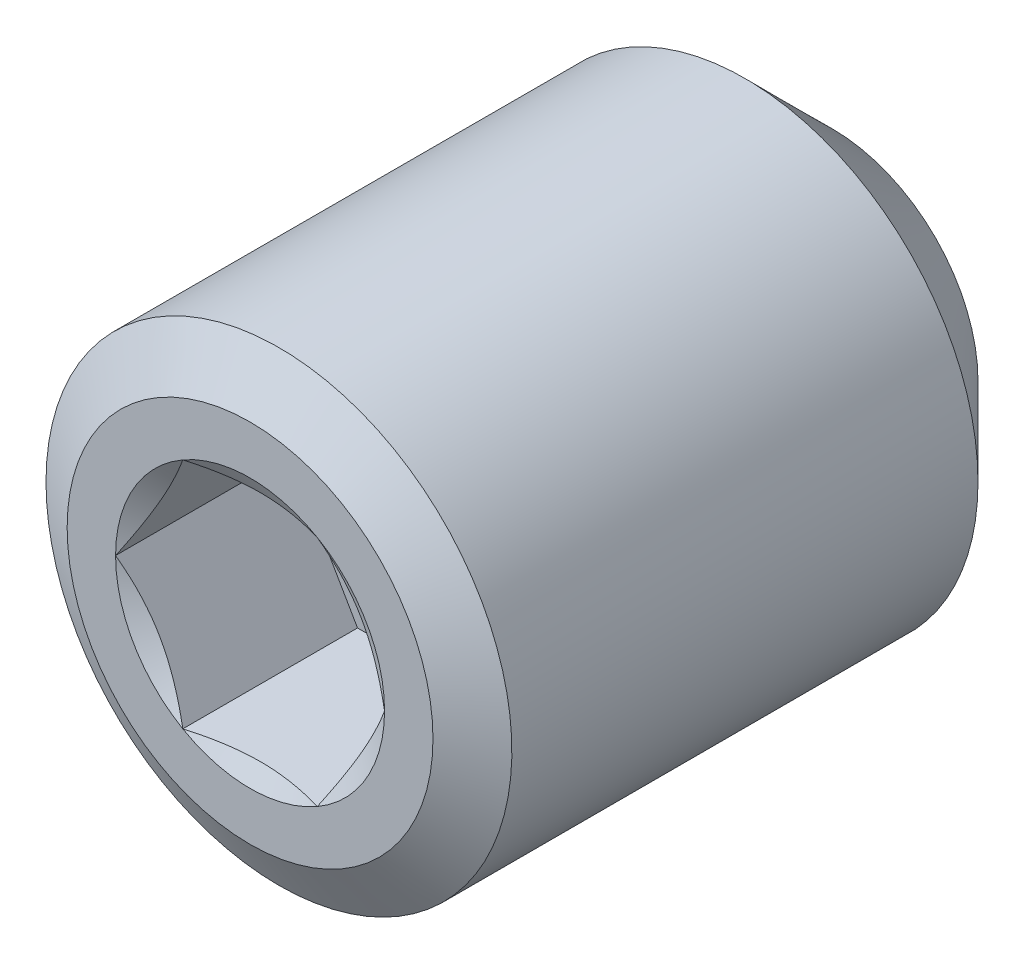
ISO-10303-21;
HEADER;
FILE_DESCRIPTION(('STEP AP214'),'2;1');
FILE_NAME('part.step','',(''),(''),'','','');
FILE_SCHEMA(('AUTOMOTIVE_DESIGN { 1 0 10303 214 1 1 1 1 }'));
ENDSEC;
DATA;
#1=APPLICATION_CONTEXT('core data for automotive mechanical design processes');
#2=APPLICATION_PROTOCOL_DEFINITION('international standard','automotive_design',2000,#1);
#3=PRODUCT_CONTEXT('',#1,'mechanical');
#4=PRODUCT('Part','Part','',(#3));
#5=PRODUCT_RELATED_PRODUCT_CATEGORY('part','',(#4));
#6=PRODUCT_DEFINITION_FORMATION('','',#4);
#7=PRODUCT_DEFINITION_CONTEXT('part definition',#1,'design');
#8=PRODUCT_DEFINITION('design','',#6,#7);
#9=PRODUCT_DEFINITION_SHAPE('','',#8);
#10=(LENGTH_UNIT() NAMED_UNIT(*) SI_UNIT(.MILLI.,.METRE.));
#11=(NAMED_UNIT(*) PLANE_ANGLE_UNIT() SI_UNIT($,.RADIAN.));
#12=(NAMED_UNIT(*) SI_UNIT($,.STERADIAN.) SOLID_ANGLE_UNIT());
#13=UNCERTAINTY_MEASURE_WITH_UNIT(LENGTH_MEASURE(1.E-05),#10,'distance_accuracy_value','');
#14=(GEOMETRIC_REPRESENTATION_CONTEXT(3) GLOBAL_UNCERTAINTY_ASSIGNED_CONTEXT((#13)) GLOBAL_UNIT_ASSIGNED_CONTEXT((#10,
#11,#12)) REPRESENTATION_CONTEXT('',''));
#15=CARTESIAN_POINT('',(0.,0.,0.));
#16=DIRECTION('',(0.,0.,1.));
#17=DIRECTION('',(1.,0.,0.));
#18=AXIS2_PLACEMENT_3D('',#15,#16,#17);
#19=CARTESIAN_POINT('',(7.87735026918963,1.,10.));
#20=DIRECTION('',(0.,1.,0.));
#21=DIRECTION('',(0.,0.,1.));
#22=AXIS2_PLACEMENT_3D('',#19,#20,#21);
#23=PLANE('',#22);
#24=DIRECTION('',(0.,0.,1.));
#25=VECTOR('',#24,1.);
#26=CARTESIAN_POINT('',(6.72264973081037,1.,10.));
#27=LINE('',#26,#25);
#28=CARTESIAN_POINT('',(6.72264973080795,1.00000000000603,10.0000000000346));
#29=VERTEX_POINT('',#28);
#30=CARTESIAN_POINT('',(6.72264973081037,1.,8.5));
#31=VERTEX_POINT('',#30);
#32=EDGE_CURVE('E73',#29,#31,#27,.F.);
#33=ORIENTED_EDGE('',*,*,#32,.T.);
#34=DIRECTION('',(-1.,0.,0.));
#35=VECTOR('',#34,1.);
#36=CARTESIAN_POINT('',(7.3,1.,8.5));
#37=LINE('',#36,#35);
#38=CARTESIAN_POINT('',(7.87735026918963,0.999999999999999,8.5));
#39=VERTEX_POINT('',#38);
#40=EDGE_CURVE('E260',#31,#39,#37,.F.);
#41=ORIENTED_EDGE('',*,*,#40,.T.);
#42=DIRECTION('',(0.,0.,1.));
#43=VECTOR('',#42,1.);
#44=CARTESIAN_POINT('',(7.87735026918963,0.999999999999998,10.));
#45=LINE('',#44,#43);
#46=CARTESIAN_POINT('',(7.87735026919245,0.999999999999999,10.0000000000686));
#47=VERTEX_POINT('',#46);
#48=EDGE_CURVE('E76',#39,#47,#45,.T.);
#49=ORIENTED_EDGE('',*,*,#48,.T.);
#50=CARTESIAN_POINT('',(6.72264973081249,1.,10.0000000000303));
#51=CARTESIAN_POINT('',(6.77004446291757,1.,9.98631688646596));
#52=CARTESIAN_POINT('',(6.81781412942871,1.,9.9737896099871));
#53=CARTESIAN_POINT('',(6.91412944760533,1.,9.95164920318649));
#54=CARTESIAN_POINT('',(6.96267658445572,1.,9.94204259308874));
#55=CARTESIAN_POINT('',(7.05922611584881,1.,9.9265940010351));
#56=CARTESIAN_POINT('',(7.10721491698777,1.,9.92066965365338));
#57=CARTESIAN_POINT('',(7.20346938392045,1.,9.9127165686833));
#58=CARTESIAN_POINT('',(7.25173469196023,1.,9.91068360254859));
#59=CARTESIAN_POINT('',(7.34826530804043,1.,9.91068360254859));
#60=CARTESIAN_POINT('',(7.39653061608086,1.,9.91271656868335));
#61=CARTESIAN_POINT('',(7.49278508301485,1.,9.92066965365365));
#62=CARTESIAN_POINT('',(7.54077388415445,1.,9.92659400103553));
#63=CARTESIAN_POINT('',(7.63732341554885,1.,9.94204259308957));
#64=CARTESIAN_POINT('',(7.6858705523999,1.,9.95164920318757));
#65=CARTESIAN_POINT('',(7.78218587057781,1.,9.97378960998872));
#66=CARTESIAN_POINT('',(7.82995553708958,1.,9.98631688646788));
#67=CARTESIAN_POINT('',(7.87735026919529,1.,10.0000000000326));
#68=B_SPLINE_CURVE_WITH_KNOTS('',3,(#50,#51,#52,#53,#54,#55,#56,#57,#58,#59,#60,#61,#62,#63,#64,
#65,#66,#67),.UNSPECIFIED.,.F.,.F.,(4,2,2,2,2,2,2,2,4),(0.,0.14803669795849,0.29640149304375,
0.44131542958406,0.586071806661002,0.730828183739916,0.875742120282206,1.02410691536954,
1.17214361333009),.UNSPECIFIED.);
#69=EDGE_CURVE('E20',#29,#47,#68,.T.);
#70=ORIENTED_EDGE('',*,*,#69,.F.);
#71=EDGE_LOOP('',(#33,#41,#49,#70));
#72=FACE_BOUND('',#71,.T.);
#73=ADVANCED_FACE('F16',(#72),#23,.F.);
#74=CARTESIAN_POINT('',(6.72264973081037,-1.,10.));
#75=DIRECTION('',(0.,-1.,0.));
#76=DIRECTION('',(0.,0.,-1.));
#77=AXIS2_PLACEMENT_3D('',#74,#75,#76);
#78=PLANE('',#77);
#79=DIRECTION('',(0.,0.,1.));
#80=VECTOR('',#79,1.);
#81=CARTESIAN_POINT('',(7.87735026918963,-1.,10.));
#82=LINE('',#81,#80);
#83=CARTESIAN_POINT('',(7.87735026918372,-1.00000000001023,10.0000000000431));
#84=VERTEX_POINT('',#83);
#85=CARTESIAN_POINT('',(7.87735026918963,-1.,8.5));
#86=VERTEX_POINT('',#85);
#87=EDGE_CURVE('E224',#84,#86,#82,.F.);
#88=ORIENTED_EDGE('',*,*,#87,.T.);
#89=DIRECTION('',(-1.,0.,0.));
#90=VECTOR('',#89,1.);
#91=CARTESIAN_POINT('',(7.3,-1.,8.5));
#92=LINE('',#91,#90);
#93=CARTESIAN_POINT('',(6.72264973081037,-0.999999999999999,8.5));
#94=VERTEX_POINT('',#93);
#95=EDGE_CURVE('E169',#86,#94,#92,.T.);
#96=ORIENTED_EDGE('',*,*,#95,.T.);
#97=DIRECTION('',(0.,0.,1.));
#98=VECTOR('',#97,1.);
#99=CARTESIAN_POINT('',(6.72264973081037,-0.999999999999998,10.));
#100=LINE('',#99,#98);
#101=CARTESIAN_POINT('',(6.72264973080584,-1.00000000000421,10.0000000000431));
#102=VERTEX_POINT('',#101);
#103=EDGE_CURVE('E88',#94,#102,#100,.T.);
#104=ORIENTED_EDGE('',*,*,#103,.T.);
#105=CARTESIAN_POINT('',(7.87735026918543,-1.,10.0000000000385));
#106=CARTESIAN_POINT('',(7.82995553708064,-1.,9.98631688647293));
#107=CARTESIAN_POINT('',(7.78218587056974,-1.,9.97378960999294));
#108=CARTESIAN_POINT('',(7.68587055239344,-1.,9.9516492031903));
#109=CARTESIAN_POINT('',(7.63732341554314,-1.,9.94204259309165));
#110=CARTESIAN_POINT('',(7.54077388415032,-1.,9.9265940010366));
#111=CARTESIAN_POINT('',(7.49278508301155,-1.,9.92066965365434));
#112=CARTESIAN_POINT('',(7.39653061607918,-1.,9.91271656868353));
#113=CARTESIAN_POINT('',(7.34826530803955,-1.,9.91068360254864));
#114=CARTESIAN_POINT('',(7.25173469196029,-1.,9.91068360254864));
#115=CARTESIAN_POINT('',(7.20346938392067,-1.,9.91271656868354));
#116=CARTESIAN_POINT('',(7.10721491698833,-1.,9.92066965365435));
#117=CARTESIAN_POINT('',(7.05922611584958,-1.,9.92659400103661));
#118=CARTESIAN_POINT('',(6.96267658445679,-1.,9.94204259309167));
#119=CARTESIAN_POINT('',(6.9141294476065,-1.,9.95164920319031));
#120=CARTESIAN_POINT('',(6.81781412943023,-1.,9.97378960999295));
#121=CARTESIAN_POINT('',(6.77004446291934,-1.,9.98631688647294));
#122=CARTESIAN_POINT('',(6.72264973081457,-1.,10.0000000000385));
#123=B_SPLINE_CURVE_WITH_KNOTS('',3,(#105,#106,#107,#108,#109,#110,#111,#112,#113,#114,#115,
#116,#117,#118,#119,#120,#121,#122),.UNSPECIFIED.,.F.,.F.,(4,2,2,2,2,2,2,2,4),(0.,
0.148036697958658,0.296401493044158,0.441315429584088,0.586071806660615,0.730828183737098,
0.875742120276982,1.02410691536243,1.17214361332105),.UNSPECIFIED.);
#124=EDGE_CURVE('E77',#84,#102,#123,.T.);
#125=ORIENTED_EDGE('',*,*,#124,.F.);
#126=EDGE_LOOP('',(#88,#96,#104,#125));
#127=FACE_BOUND('',#126,.T.);
#128=ADVANCED_FACE('F161',(#127),#78,.F.);
#129=CARTESIAN_POINT('',(7.3,0.,8.5));
#130=DIRECTION('',(0.,0.,-1.));
#131=DIRECTION('',(-1.,0.,0.));
#132=AXIS2_PLACEMENT_3D('',#129,#130,#131);
#133=PLANE('',#132);
#134=ORIENTED_EDGE('',*,*,#40,.F.);
#135=DIRECTION('',(-0.5,-0.866025403784439,0.));
#136=VECTOR('',#135,1.);
#137=CARTESIAN_POINT('',(6.72264973081037,1.,8.5));
#138=LINE('',#137,#136);
#139=CARTESIAN_POINT('',(6.14529946162075,0.,8.5));
#140=VERTEX_POINT('',#139);
#141=EDGE_CURVE('E87',#31,#140,#138,.T.);
#142=ORIENTED_EDGE('',*,*,#141,.T.);
#143=DIRECTION('',(0.5,-0.866025403784439,0.));
#144=VECTOR('',#143,1.);
#145=CARTESIAN_POINT('',(6.14529946162075,0.,8.5));
#146=LINE('',#145,#144);
#147=EDGE_CURVE('E250',#140,#94,#146,.T.);
#148=ORIENTED_EDGE('',*,*,#147,.T.);
#149=ORIENTED_EDGE('',*,*,#95,.F.);
#150=DIRECTION('',(0.5,0.866025403784439,0.));
#151=VECTOR('',#150,1.);
#152=CARTESIAN_POINT('',(7.87735026918963,-1.,8.5));
#153=LINE('',#152,#151);
#154=CARTESIAN_POINT('',(8.45470053837925,0.,8.5));
#155=VERTEX_POINT('',#154);
#156=EDGE_CURVE('E226',#86,#155,#153,.T.);
#157=ORIENTED_EDGE('',*,*,#156,.T.);
#158=DIRECTION('',(-0.5,0.866025403784439,0.));
#159=VECTOR('',#158,1.);
#160=CARTESIAN_POINT('',(8.45470053837925,0.,8.5));
#161=LINE('',#160,#159);
#162=EDGE_CURVE('E232',#155,#39,#161,.T.);
#163=ORIENTED_EDGE('',*,*,#162,.T.);
#164=EDGE_LOOP('',(#134,#142,#148,#149,#157,#163));
#165=FACE_BOUND('',#164,.T.);
#166=ADVANCED_FACE('F158',(#165),#133,.F.);
#167=CARTESIAN_POINT('',(6.14529946162075,0.,10.));
#168=DIRECTION('',(-0.866025403784439,-0.5,0.));
#169=DIRECTION('',(0.5,-0.866025403784439,0.));
#170=AXIS2_PLACEMENT_3D('',#167,#168,#169);
#171=PLANE('',#170);
#172=ORIENTED_EDGE('',*,*,#103,.F.);
#173=ORIENTED_EDGE('',*,*,#147,.F.);
#174=DIRECTION('',(0.,0.,1.));
#175=VECTOR('',#174,1.);
#176=CARTESIAN_POINT('',(6.14529946162075,0.,10.));
#177=LINE('',#176,#175);
#178=CARTESIAN_POINT('',(6.14529946161431,-8.96526093013981E-13,10.0000000000434));
#179=VERTEX_POINT('',#178);
#180=EDGE_CURVE('E242',#140,#179,#177,.T.);
#181=ORIENTED_EDGE('',*,*,#180,.T.);
#182=CARTESIAN_POINT('',(6.14529946162179,-1.79319359607302E-12,10.0000000000391));
#183=CARTESIAN_POINT('',(6.17067050939324,-0.0439439437832087,9.9853477726028));
#184=CARTESIAN_POINT('',(6.19626055968811,-0.0882672110621721,9.97202233858992));
#185=CARTESIAN_POINT('',(6.24788373488103,-0.177681173344336,9.94876319374054));
#186=CARTESIAN_POINT('',(6.27391777672441,-0.222773456543446,9.93883771020972));
#187=CARTESIAN_POINT('',(6.32566323358121,-0.312399216880281,9.92338797951412));
#188=CARTESIAN_POINT('',(6.3513666891231,-0.356918907808925,9.91776089383969));
#189=CARTESIAN_POINT('',(6.40289448035907,-0.446167660231435,9.91104458410664));
#190=CARTESIAN_POINT('',(6.42871862889216,-0.49089639755294,9.90994979702856));
#191=CARTESIAN_POINT('',(6.47696828007823,-0.574467244854695,9.9122331451188));
#192=CARTESIAN_POINT('',(6.49940102298446,-0.613321895321417,9.91505064264945));
#193=CARTESIAN_POINT('',(6.54412036679432,-0.690778070881226,9.92397865040011));
#194=CARTESIAN_POINT('',(6.56640681314112,-0.729379328274043,9.93009220742516));
#195=CARTESIAN_POINT('',(6.61121828301658,-0.806995070860181,9.94537491670948));
#196=CARTESIAN_POINT('',(6.63373763791005,-0.845999737689353,9.95460882114915));
#197=CARTESIAN_POINT('',(6.67844056866225,-0.923427484999392,9.97556588045897));
#198=CARTESIAN_POINT('',(6.7006247167754,-0.96185155665401,9.98728411441502));
#199=CARTESIAN_POINT('',(6.72264973080827,-0.999999999996361,10.0000000000385));
#200=B_SPLINE_CURVE_WITH_KNOTS('',3,(#182,#183,#184,#185,#186,#187,#188,#189,#190,#191,#192,
#193,#194,#195,#196,#197,#198,#199),.UNSPECIFIED.,.F.,.F.,(4,2,2,2,2,2,2,2,4),(0.,
0.158508005777772,0.31739690851222,0.472353803074637,0.627120444446608,0.761853891312512,
0.896712096892626,1.03456081123844,1.17213898675029),.UNSPECIFIED.);
#201=EDGE_CURVE('E95',#179,#102,#200,.T.);
#202=ORIENTED_EDGE('',*,*,#201,.T.);
#203=EDGE_LOOP('',(#172,#173,#181,#202));
#204=FACE_BOUND('',#203,.T.);
#205=ADVANCED_FACE('F153',(#204),#171,.F.);
#206=CARTESIAN_POINT('',(6.72264973081037,1.,10.));
#207=DIRECTION('',(-0.866025403784439,0.5,0.));
#208=DIRECTION('',(-0.5,-0.866025403784439,0.));
#209=AXIS2_PLACEMENT_3D('',#206,#207,#208);
#210=PLANE('',#209);
#211=ORIENTED_EDGE('',*,*,#180,.F.);
#212=ORIENTED_EDGE('',*,*,#141,.F.);
#213=ORIENTED_EDGE('',*,*,#32,.F.);
#214=CARTESIAN_POINT('',(6.72264973080814,0.999999999996138,10.0000000000384));
#215=CARTESIAN_POINT('',(6.69727868303671,0.956056056214756,9.98534777260217));
#216=CARTESIAN_POINT('',(6.67168863274185,0.911732788935826,9.97202233858934));
#217=CARTESIAN_POINT('',(6.62006545754897,0.822318826653732,9.94876319374009));
#218=CARTESIAN_POINT('',(6.59403141570561,0.77722654345466,9.93883771020933));
#219=CARTESIAN_POINT('',(6.54228595884886,0.6876007831179,9.92338797951387));
#220=CARTESIAN_POINT('',(6.51658250330699,0.643081092189294,9.9177608938395));
#221=CARTESIAN_POINT('',(6.46505471207106,0.553832339766864,9.91104458410658));
#222=CARTESIAN_POINT('',(6.43923056353801,0.509103602445402,9.90994979702855));
#223=CARTESIAN_POINT('',(6.39098091235194,0.425532755143668,9.9122331451189));
#224=CARTESIAN_POINT('',(6.3685481694457,0.386678104676924,9.91505064264959));
#225=CARTESIAN_POINT('',(6.32382882563582,0.309221929117074,9.92397865040035));
#226=CARTESIAN_POINT('',(6.30154237928901,0.270620671724237,9.93009220742545));
#227=CARTESIAN_POINT('',(6.25673090941353,0.193004929138063,9.94537491670988));
#228=CARTESIAN_POINT('',(6.23421155452005,0.154000262308873,9.95460882114959));
#229=CARTESIAN_POINT('',(6.18950862376783,0.0765725149987986,9.97556588045951));
#230=CARTESIAN_POINT('',(6.16732447565466,0.0381484433441639,9.98728411441559));
#231=CARTESIAN_POINT('',(6.14529946162178,1.79677529780038E-12,10.0000000000391));
#232=B_SPLINE_CURVE_WITH_KNOTS('',3,(#214,#215,#216,#217,#218,#219,#220,#221,#222,#223,#224,
#225,#226,#227,#228,#229,#230,#231),.UNSPECIFIED.,.F.,.F.,(4,2,2,2,2,2,2,2,4),(0.,
0.158508005777613,0.317396908511899,0.472353803074164,0.627120444445985,0.761853891311975,
0.896712096892174,1.03456081123807,1.17213898675001),.UNSPECIFIED.);
#233=EDGE_CURVE('E84',#29,#179,#232,.T.);
#234=ORIENTED_EDGE('',*,*,#233,.T.);
#235=EDGE_LOOP('',(#211,#212,#213,#234));
#236=FACE_BOUND('',#235,.T.);
#237=ADVANCED_FACE('F83',(#236),#210,.F.);
#238=CARTESIAN_POINT('',(8.45470053837925,0.,10.));
#239=DIRECTION('',(0.866025403784439,0.5,0.));
#240=DIRECTION('',(-0.5,0.866025403784439,0.));
#241=AXIS2_PLACEMENT_3D('',#238,#239,#240);
#242=PLANE('',#241);
#243=ORIENTED_EDGE('',*,*,#48,.F.);
#244=ORIENTED_EDGE('',*,*,#162,.F.);
#245=DIRECTION('',(0.,0.,1.));
#246=VECTOR('',#245,1.);
#247=CARTESIAN_POINT('',(8.45470053837925,0.,10.));
#248=LINE('',#247,#246);
#249=CARTESIAN_POINT('',(8.45470053838569,8.96092019980319E-13,10.0000000000434));
#250=VERTEX_POINT('',#249);
#251=EDGE_CURVE('E38',#155,#250,#248,.T.);
#252=ORIENTED_EDGE('',*,*,#251,.T.);
#253=CARTESIAN_POINT('',(8.45470053837821,1.79246686003752E-12,10.0000000000391));
#254=CARTESIAN_POINT('',(8.42932949060676,0.0439439437832101,9.9853477726028));
#255=CARTESIAN_POINT('',(8.40373944031188,0.088267211062176,9.97202233858991));
#256=CARTESIAN_POINT('',(8.35211626511896,0.177681173344345,9.94876319374054));
#257=CARTESIAN_POINT('',(8.32608222327558,0.222773456543457,9.93883771020972));
#258=CARTESIAN_POINT('',(8.27433676641878,0.312399216880293,9.92338797951412));
#259=CARTESIAN_POINT('',(8.2486333108769,0.356918907808934,9.91776089383968));
#260=CARTESIAN_POINT('',(8.19710551964092,0.44616766023144,9.91104458410664));
#261=CARTESIAN_POINT('',(8.17128137110784,0.490896397552942,9.90994979702856));
#262=CARTESIAN_POINT('',(8.12303171992145,0.574467244855244,9.91223314511882));
#263=CARTESIAN_POINT('',(8.10059897701491,0.613321895322514,9.91505064264953));
#264=CARTESIAN_POINT('',(8.05587963320442,0.690778070883412,9.9239786504004));
#265=CARTESIAN_POINT('',(8.03359318685731,0.729379328276768,9.93009220742561));
#266=CARTESIAN_POINT('',(7.98878171698122,0.806995070863997,9.94537491671032));
#267=CARTESIAN_POINT('',(7.96626236208743,0.845999737693721,9.95460882115022));
#268=CARTESIAN_POINT('',(7.9215594313346,0.923427485004843,9.97556588046056));
#269=CARTESIAN_POINT('',(7.89937528322114,0.961851556659993,9.98728411441689));
#270=CARTESIAN_POINT('',(7.87735026918797,1.00000000000287,10.0000000000407));
#271=B_SPLINE_CURVE_WITH_KNOTS('',3,(#253,#254,#255,#256,#257,#258,#259,#260,#261,#262,#263,
#264,#265,#266,#267,#268,#269,#270),.UNSPECIFIED.,.F.,.F.,(4,2,2,2,2,2,2,2,4),(0.,
0.15850800577778,0.317396908512237,0.472353803074646,0.627120444446608,0.761853891314415,
0.896712096896439,1.03456081124426,1.1721389867581),.UNSPECIFIED.);
#272=EDGE_CURVE('E94',#250,#47,#271,.T.);
#273=ORIENTED_EDGE('',*,*,#272,.T.);
#274=EDGE_LOOP('',(#243,#244,#252,#273));
#275=FACE_BOUND('',#274,.T.);
#276=ADVANCED_FACE('F152',(#275),#242,.F.);
#277=CARTESIAN_POINT('',(7.87735026918963,-1.,10.));
#278=DIRECTION('',(0.866025403784439,-0.5,0.));
#279=DIRECTION('',(0.5,0.866025403784439,0.));
#280=AXIS2_PLACEMENT_3D('',#277,#278,#279);
#281=PLANE('',#280);
#282=ORIENTED_EDGE('',*,*,#251,.F.);
#283=ORIENTED_EDGE('',*,*,#156,.F.);
#284=ORIENTED_EDGE('',*,*,#87,.F.);
#285=CARTESIAN_POINT('',(7.87735026919173,-0.999999999996362,10.0000000000385));
#286=CARTESIAN_POINT('',(7.90272131696317,-0.956056056214976,9.98534777260223));
#287=CARTESIAN_POINT('',(7.92831136725802,-0.911732788936042,9.97202233858941));
#288=CARTESIAN_POINT('',(7.97993454245091,-0.822318826653941,9.94876319374014));
#289=CARTESIAN_POINT('',(8.00596858429427,-0.777226543454865,9.93883771020938));
#290=CARTESIAN_POINT('',(8.05771404115103,-0.687600783118097,9.9233879795139));
#291=CARTESIAN_POINT('',(8.0834174966929,-0.643081092189487,9.91776089383952));
#292=CARTESIAN_POINT('',(8.13494528792883,-0.553832339767048,9.91104458410658));
#293=CARTESIAN_POINT('',(8.16076943646189,-0.509103602445582,9.90994979702855));
#294=CARTESIAN_POINT('',(8.20901908764796,-0.425532755143828,9.91223314511889));
#295=CARTESIAN_POINT('',(8.23145183055422,-0.38667810467707,9.91505064264958));
#296=CARTESIAN_POINT('',(8.27617117436411,-0.30922192911719,9.92397865040034));
#297=CARTESIAN_POINT('',(8.29845762071093,-0.270620671724339,9.93009220742544));
#298=CARTESIAN_POINT('',(8.34326909058643,-0.193004929138134,9.94537491670986));
#299=CARTESIAN_POINT('',(8.36578844547992,-0.15400026230893,9.95460882114958));
#300=CARTESIAN_POINT('',(8.41049137623216,-0.0765725149988268,9.9755658804595));
#301=CARTESIAN_POINT('',(8.43267552434533,-0.0381484433441779,9.98728411441559));
#302=CARTESIAN_POINT('',(8.45470053837822,-1.79620034051698E-12,10.0000000000391));
#303=B_SPLINE_CURVE_WITH_KNOTS('',3,(#285,#286,#287,#288,#289,#290,#291,#292,#293,#294,#295,
#296,#297,#298,#299,#300,#301,#302),.UNSPECIFIED.,.F.,.F.,(4,2,2,2,2,2,2,2,4),(0.,
0.158508005777631,0.317396908511935,0.472353803074216,0.627120444446052,0.761853891312092,
0.896712096892342,1.03456081123829,1.17213898675028),.UNSPECIFIED.);
#304=EDGE_CURVE('E108',#84,#250,#303,.T.);
#305=ORIENTED_EDGE('',*,*,#304,.T.);
#306=EDGE_LOOP('',(#282,#283,#284,#305));
#307=FACE_BOUND('',#306,.T.);
#308=ADVANCED_FACE('F120',(#307),#281,.F.);
#309=CARTESIAN_POINT('',(7.3,0.,10.0000000000477));
#310=DIRECTION('',(0.,0.,1.));
#311=DIRECTION('',(1.,0.,0.));
#312=AXIS2_PLACEMENT_3D('',#309,#310,#311);
#313=CONICAL_SURFACE('',#312,1.15470053839317,1.04719755112858);
#314=ORIENTED_EDGE('',*,*,#124,.T.);
#315=CARTESIAN_POINT('',(7.3,0.,10.0000000000477));
#316=DIRECTION('',(0.,0.,1.));
#317=DIRECTION('',(1.,0.,0.));
#318=AXIS2_PLACEMENT_3D('',#315,#316,#317);
#319=CIRCLE('',#318,1.15470053839317);
#320=EDGE_CURVE('E103',#84,#102,#319,.F.);
#321=ORIENTED_EDGE('',*,*,#320,.F.);
#322=EDGE_LOOP('',(#314,#321));
#323=FACE_BOUND('',#322,.T.);
#324=ADVANCED_FACE('F170',(#323),#313,.F.);
#325=CARTESIAN_POINT('',(7.3,0.,10.0000000000477));
#326=DIRECTION('',(0.,0.,1.));
#327=DIRECTION('',(1.,0.,0.));
#328=AXIS2_PLACEMENT_3D('',#325,#326,#327);
#329=CONICAL_SURFACE('',#328,1.15470053839317,1.04719755120501);
#330=CARTESIAN_POINT('',(7.3,0.,10.0000000000477));
#331=DIRECTION('',(0.,0.,1.));
#332=DIRECTION('',(1.,0.,0.));
#333=AXIS2_PLACEMENT_3D('',#330,#331,#332);
#334=CIRCLE('',#333,1.15470053839317);
#335=EDGE_CURVE('E101',#102,#179,#334,.F.);
#336=ORIENTED_EDGE('',*,*,#335,.F.);
#337=ORIENTED_EDGE('',*,*,#201,.F.);
#338=EDGE_LOOP('',(#336,#337));
#339=FACE_BOUND('',#338,.T.);
#340=ADVANCED_FACE('F139',(#339),#329,.F.);
#341=CARTESIAN_POINT('',(7.3,0.,10.0000000000477));
#342=DIRECTION('',(0.,0.,1.));
#343=DIRECTION('',(1.,0.,0.));
#344=AXIS2_PLACEMENT_3D('',#341,#342,#343);
#345=CONICAL_SURFACE('',#344,1.15470053839317,1.04719755120501);
#346=CARTESIAN_POINT('',(7.3,0.,10.0000000000477));
#347=DIRECTION('',(0.,0.,1.));
#348=DIRECTION('',(1.,0.,0.));
#349=AXIS2_PLACEMENT_3D('',#346,#347,#348);
#350=CIRCLE('',#349,1.15470053839317);
#351=EDGE_CURVE('E66',#179,#29,#350,.F.);
#352=ORIENTED_EDGE('',*,*,#351,.F.);
#353=ORIENTED_EDGE('',*,*,#233,.F.);
#354=EDGE_LOOP('',(#352,#353));
#355=FACE_BOUND('',#354,.T.);
#356=ADVANCED_FACE('F92',(#355),#345,.F.);
#357=CARTESIAN_POINT('',(7.3,0.,10.0000000001046));
#358=DIRECTION('',(0.,0.,1.));
#359=DIRECTION('',(1.,0.,0.));
#360=AXIS2_PLACEMENT_3D('',#357,#358,#359);
#361=CONICAL_SURFACE('',#360,1.15470053850686,1.04719755117096);
#362=ORIENTED_EDGE('',*,*,#69,.T.);
#363=CARTESIAN_POINT('',(7.3,0.,10.0000000001046));
#364=DIRECTION('',(0.,0.,1.));
#365=DIRECTION('',(1.,0.,0.));
#366=AXIS2_PLACEMENT_3D('',#363,#364,#365);
#367=CIRCLE('',#366,1.15470053850686);
#368=EDGE_CURVE('E58',#29,#47,#367,.F.);
#369=ORIENTED_EDGE('',*,*,#368,.F.);
#370=EDGE_LOOP('',(#362,#369));
#371=FACE_BOUND('',#370,.T.);
#372=ADVANCED_FACE('F60',(#371),#361,.F.);
#373=CARTESIAN_POINT('',(7.3,0.,10.0000000000477));
#374=DIRECTION('',(0.,0.,1.));
#375=DIRECTION('',(1.,0.,0.));
#376=AXIS2_PLACEMENT_3D('',#373,#374,#375);
#377=CONICAL_SURFACE('',#376,1.15470053839317,1.04719755120501);
#378=CARTESIAN_POINT('',(7.3,0.,10.0000000000477));
#379=DIRECTION('',(0.,0.,1.));
#380=DIRECTION('',(1.,0.,0.));
#381=AXIS2_PLACEMENT_3D('',#378,#379,#380);
#382=CIRCLE('',#381,1.15470053839317);
#383=EDGE_CURVE('E65',#47,#250,#382,.F.);
#384=ORIENTED_EDGE('',*,*,#383,.F.);
#385=ORIENTED_EDGE('',*,*,#272,.F.);
#386=EDGE_LOOP('',(#384,#385));
#387=FACE_BOUND('',#386,.T.);
#388=ADVANCED_FACE('F127',(#387),#377,.F.);
#389=CARTESIAN_POINT('',(7.3,0.,10.0000000000477));
#390=DIRECTION('',(0.,0.,1.));
#391=DIRECTION('',(1.,0.,0.));
#392=AXIS2_PLACEMENT_3D('',#389,#390,#391);
#393=CONICAL_SURFACE('',#392,1.15470053839317,1.04719755120501);
#394=CARTESIAN_POINT('',(7.3,0.,10.0000000000477));
#395=DIRECTION('',(0.,0.,1.));
#396=DIRECTION('',(1.,0.,0.));
#397=AXIS2_PLACEMENT_3D('',#394,#395,#396);
#398=CIRCLE('',#397,1.15470053839317);
#399=EDGE_CURVE('E210',#250,#84,#398,.F.);
#400=ORIENTED_EDGE('',*,*,#399,.F.);
#401=ORIENTED_EDGE('',*,*,#304,.F.);
#402=EDGE_LOOP('',(#400,#401));
#403=FACE_BOUND('',#402,.T.);
#404=ADVANCED_FACE('F123',(#403),#393,.F.);
#405=CARTESIAN_POINT('',(7.3,-1.36260026918963,10.));
#406=DIRECTION('',(0.,0.,1.));
#407=DIRECTION('',(0.,-1.,0.));
#408=AXIS2_PLACEMENT_3D('',#405,#406,#407);
#409=PLANE('',#408);
#410=ORIENTED_EDGE('',*,*,#383,.T.);
#411=ORIENTED_EDGE('',*,*,#399,.T.);
#412=ORIENTED_EDGE('',*,*,#320,.T.);
#413=ORIENTED_EDGE('',*,*,#335,.T.);
#414=ORIENTED_EDGE('',*,*,#351,.T.);
#415=ORIENTED_EDGE('',*,*,#368,.T.);
#416=EDGE_LOOP('',(#410,#411,#412,#413,#414,#415));
#417=FACE_BOUND('',#416,.T.);
#418=CARTESIAN_POINT('',(7.3,0.,10.0000000000149));
#419=DIRECTION('',(0.,0.,-1.));
#420=DIRECTION('',(-1.,0.,0.));
#421=AXIS2_PLACEMENT_3D('',#418,#419,#420);
#422=CIRCLE('',#421,1.57050000012759);
#423=CARTESIAN_POINT('',(5.7294999998724,0.,10.0000000000149));
#424=VERTEX_POINT('',#423);
#425=EDGE_CURVE('E206',#424,#424,#422,.T.);
#426=ORIENTED_EDGE('',*,*,#425,.F.);
#427=EDGE_LOOP('',(#426));
#428=FACE_BOUND('',#427,.T.);
#429=ADVANCED_FACE('F97',(#417,#428),#409,.T.);
#430=CARTESIAN_POINT('',(7.3,-0.625,5.));
#431=DIRECTION('',(0.,0.,-1.));
#432=DIRECTION('',(-1.,0.,0.));
#433=AXIS2_PLACEMENT_3D('',#430,#431,#432);
#434=PLANE('',#433);
#435=CARTESIAN_POINT('',(7.3,0.,5.00000000016598));
#436=DIRECTION('',(0.,0.,1.));
#437=DIRECTION('',(1.,0.,0.));
#438=AXIS2_PLACEMENT_3D('',#435,#436,#437);
#439=CIRCLE('',#438,1.25000000014097);
#440=CARTESIAN_POINT('',(8.55000000014097,0.,5.00000000016598));
#441=VERTEX_POINT('',#440);
#442=EDGE_CURVE('E205',#441,#441,#439,.T.);
#443=ORIENTED_EDGE('',*,*,#442,.F.);
#444=EDGE_LOOP('',(#443));
#445=FACE_BOUND('',#444,.T.);
#446=ADVANCED_FACE('F196',(#445),#434,.T.);
#447=CARTESIAN_POINT('',(7.3,0.,9.75202805938125));
#448=DIRECTION('',(0.,0.,-1.));
#449=DIRECTION('',(-1.,0.,0.));
#450=AXIS2_PLACEMENT_3D('',#447,#448,#449);
#451=CONICAL_SURFACE('',#450,2.00000000012324,1.04719755116297);
#452=ORIENTED_EDGE('',*,*,#425,.T.);
#453=EDGE_LOOP('',(#452));
#454=FACE_BOUND('',#453,.T.);
#455=CARTESIAN_POINT('',(7.3,0.,9.75202805938306));
#456=DIRECTION('',(0.,0.,1.));
#457=DIRECTION('',(0.,-1.,0.));
#458=AXIS2_PLACEMENT_3D('',#455,#456,#457);
#459=CIRCLE('',#458,2.);
#460=CARTESIAN_POINT('',(7.3,-2.,9.75202805938306));
#461=VERTEX_POINT('',#460);
#462=EDGE_CURVE('E30',#461,#461,#459,.F.);
#463=ORIENTED_EDGE('',*,*,#462,.F.);
#464=EDGE_LOOP('',(#463));
#465=FACE_BOUND('',#464,.T.);
#466=ADVANCED_FACE('F189',(#454,#465),#451,.T.);
#467=CARTESIAN_POINT('',(7.3,0.,5.74999999992087));
#468=DIRECTION('',(0.,0.,1.));
#469=DIRECTION('',(1.,0.,0.));
#470=AXIS2_PLACEMENT_3D('',#467,#468,#469);
#471=CONICAL_SURFACE('',#470,1.99999999995271,0.785398163435344);
#472=ORIENTED_EDGE('',*,*,#442,.T.);
#473=EDGE_LOOP('',(#472));
#474=FACE_BOUND('',#473,.T.);
#475=CARTESIAN_POINT('',(7.3,0.,5.75));
#476=DIRECTION('',(0.,0.,1.));
#477=DIRECTION('',(0.,-1.,0.));
#478=AXIS2_PLACEMENT_3D('',#475,#476,#477);
#479=CIRCLE('',#478,2.);
#480=CARTESIAN_POINT('',(7.3,-2.,5.75));
#481=VERTEX_POINT('',#480);
#482=EDGE_CURVE('E10',#481,#481,#479,.T.);
#483=ORIENTED_EDGE('',*,*,#482,.F.);
#484=EDGE_LOOP('',(#483));
#485=FACE_BOUND('',#484,.T.);
#486=ADVANCED_FACE('F183',(#474,#485),#471,.T.);
#487=CARTESIAN_POINT('',(7.3,0.,7.75101402969153));
#488=DIRECTION('',(0.,0.,1.));
#489=DIRECTION('',(0.,-1.,0.));
#490=AXIS2_PLACEMENT_3D('',#487,#488,#489);
#491=CYLINDRICAL_SURFACE('',#490,2.);
#492=ORIENTED_EDGE('',*,*,#462,.T.);
#493=EDGE_LOOP('',(#492));
#494=FACE_BOUND('',#493,.T.);
#495=ORIENTED_EDGE('',*,*,#482,.T.);
#496=EDGE_LOOP('',(#495));
#497=FACE_BOUND('',#496,.T.);
#498=ADVANCED_FACE('F181',(#494,#497),#491,.T.);
#499=CLOSED_SHELL('',(#73,#128,#166,#205,#237,#276,#308,#324,#340,#356,#372,#388,#404,#429,#446,
#466,#486,#498));
#500=MANIFOLD_SOLID_BREP('B1',#499);
#501=ADVANCED_BREP_SHAPE_REPRESENTATION('',(#18,#500),#14);
#502=SHAPE_DEFINITION_REPRESENTATION(#9,#501);
ENDSEC;
END-ISO-10303-21;
